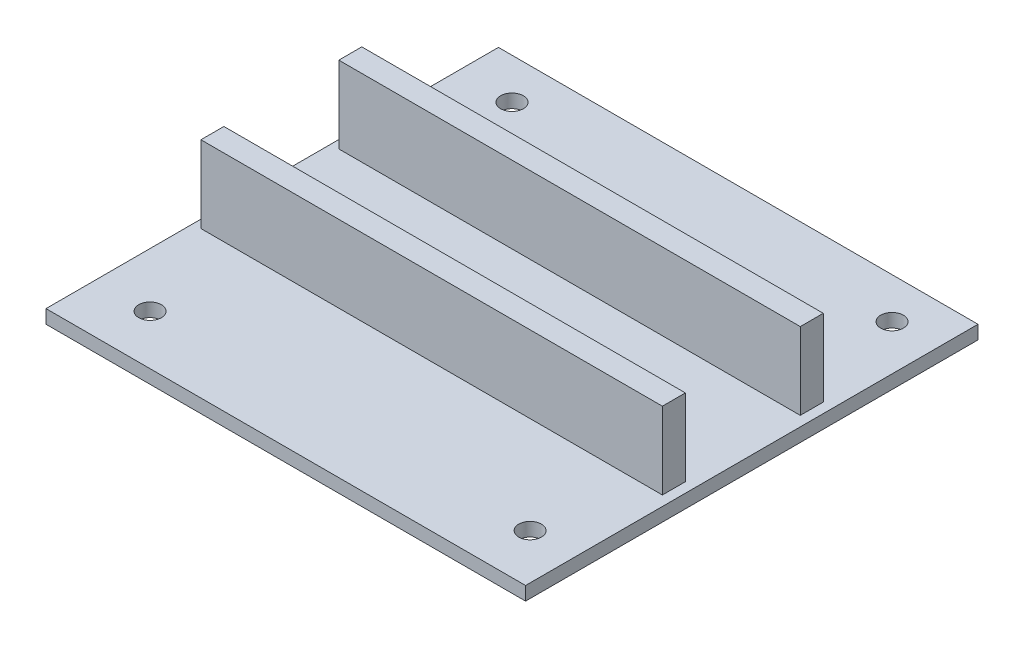
ISO-10303-21;
HEADER;
FILE_DESCRIPTION(('STEP AP214'),'2;1');
FILE_NAME('part.step','',(''),(''),'','','');
FILE_SCHEMA(('AUTOMOTIVE_DESIGN { 1 0 10303 214 1 1 1 1 }'));
ENDSEC;
DATA;
#1=APPLICATION_CONTEXT('core data for automotive mechanical design processes');
#2=APPLICATION_PROTOCOL_DEFINITION('international standard','automotive_design',2000,#1);
#3=PRODUCT_CONTEXT('',#1,'mechanical');
#4=PRODUCT('Part','Part','',(#3));
#5=PRODUCT_RELATED_PRODUCT_CATEGORY('part','',(#4));
#6=PRODUCT_DEFINITION_FORMATION('','',#4);
#7=PRODUCT_DEFINITION_CONTEXT('part definition',#1,'design');
#8=PRODUCT_DEFINITION('design','',#6,#7);
#9=PRODUCT_DEFINITION_SHAPE('','',#8);
#10=(LENGTH_UNIT() NAMED_UNIT(*) SI_UNIT(.MILLI.,.METRE.));
#11=(NAMED_UNIT(*) PLANE_ANGLE_UNIT() SI_UNIT($,.RADIAN.));
#12=(NAMED_UNIT(*) SI_UNIT($,.STERADIAN.) SOLID_ANGLE_UNIT());
#13=UNCERTAINTY_MEASURE_WITH_UNIT(LENGTH_MEASURE(1.E-05),#10,'distance_accuracy_value','');
#14=(GEOMETRIC_REPRESENTATION_CONTEXT(3) GLOBAL_UNCERTAINTY_ASSIGNED_CONTEXT((#13)) GLOBAL_UNIT_ASSIGNED_CONTEXT((#10,
#11,#12)) REPRESENTATION_CONTEXT('',''));
#15=CARTESIAN_POINT('',(0.,0.,0.));
#16=DIRECTION('',(0.,0.,1.));
#17=DIRECTION('',(1.,0.,0.));
#18=AXIS2_PLACEMENT_3D('',#15,#16,#17);
#19=CARTESIAN_POINT('',(0.,1.5,0.));
#20=DIRECTION('',(0.,-1.,0.));
#21=DIRECTION('',(0.,0.,-1.));
#22=AXIS2_PLACEMENT_3D('',#19,#20,#21);
#23=PLANE('',#22);
#24=CARTESIAN_POINT('',(-20.5,1.5,19.5));
#25=DIRECTION('',(0.,1.,0.));
#26=DIRECTION('',(0.,0.,1.));
#27=AXIS2_PLACEMENT_3D('',#24,#25,#26);
#28=CIRCLE('',#27,1.25);
#29=CARTESIAN_POINT('',(-20.5,1.5,20.75));
#30=VERTEX_POINT('',#29);
#31=EDGE_CURVE('E227',#30,#30,#28,.T.);
#32=ORIENTED_EDGE('',*,*,#31,.F.);
#33=EDGE_LOOP('',(#32));
#34=FACE_BOUND('',#33,.T.);
#35=CARTESIAN_POINT('',(21.5,1.5,19.5));
#36=DIRECTION('',(0.,1.,0.));
#37=DIRECTION('',(0.,0.,1.));
#38=AXIS2_PLACEMENT_3D('',#35,#36,#37);
#39=CIRCLE('',#38,1.25);
#40=CARTESIAN_POINT('',(21.5,1.5,20.75));
#41=VERTEX_POINT('',#40);
#42=EDGE_CURVE('E217',#41,#41,#39,.T.);
#43=ORIENTED_EDGE('',*,*,#42,.F.);
#44=EDGE_LOOP('',(#43));
#45=FACE_BOUND('',#44,.T.);
#46=CARTESIAN_POINT('',(-20.5,1.5,-20.5));
#47=DIRECTION('',(0.,1.,0.));
#48=DIRECTION('',(0.,0.,1.));
#49=AXIS2_PLACEMENT_3D('',#46,#47,#48);
#50=CIRCLE('',#49,1.25);
#51=CARTESIAN_POINT('',(-20.5,1.5,-19.25));
#52=VERTEX_POINT('',#51);
#53=EDGE_CURVE('E214',#52,#52,#50,.T.);
#54=ORIENTED_EDGE('',*,*,#53,.F.);
#55=EDGE_LOOP('',(#54));
#56=FACE_BOUND('',#55,.T.);
#57=CARTESIAN_POINT('',(21.5,1.5,-20.5));
#58=DIRECTION('',(0.,1.,0.));
#59=DIRECTION('',(0.,0.,1.));
#60=AXIS2_PLACEMENT_3D('',#57,#58,#59);
#61=CIRCLE('',#60,1.25);
#62=CARTESIAN_POINT('',(21.5,1.5,-19.25));
#63=VERTEX_POINT('',#62);
#64=EDGE_CURVE('E211',#63,#63,#61,.T.);
#65=ORIENTED_EDGE('',*,*,#64,.F.);
#66=EDGE_LOOP('',(#65));
#67=FACE_BOUND('',#66,.T.);
#68=DIRECTION('',(0.,0.,1.));
#69=VECTOR('',#68,1.);
#70=CARTESIAN_POINT('',(-25.6,1.5,-9.00000000000001));
#71=LINE('',#70,#69);
#72=CARTESIAN_POINT('',(-25.6,1.5,-9.00000000000001));
#73=VERTEX_POINT('',#72);
#74=CARTESIAN_POINT('',(-25.6,1.5,-6.46));
#75=VERTEX_POINT('',#74);
#76=EDGE_CURVE('E144',#73,#75,#71,.T.);
#77=ORIENTED_EDGE('',*,*,#76,.F.);
#78=DIRECTION('',(-1.,0.,0.));
#79=VECTOR('',#78,1.);
#80=CARTESIAN_POINT('',(-25.6,1.5,-9.00000000000001));
#81=LINE('',#80,#79);
#82=CARTESIAN_POINT('',(25.4,1.5,-9.00000000000001));
#83=VERTEX_POINT('',#82);
#84=EDGE_CURVE('E157',#83,#73,#81,.T.);
#85=ORIENTED_EDGE('',*,*,#84,.F.);
#86=DIRECTION('',(0.,0.,-1.));
#87=VECTOR('',#86,1.);
#88=CARTESIAN_POINT('',(25.4,1.5,-9.00000000000001));
#89=LINE('',#88,#87);
#90=CARTESIAN_POINT('',(25.4,1.5,-6.46));
#91=VERTEX_POINT('',#90);
#92=EDGE_CURVE('E166',#91,#83,#89,.T.);
#93=ORIENTED_EDGE('',*,*,#92,.F.);
#94=DIRECTION('',(1.,0.,0.));
#95=VECTOR('',#94,1.);
#96=CARTESIAN_POINT('',(-25.6,1.5,-6.46));
#97=LINE('',#96,#95);
#98=EDGE_CURVE('E147',#75,#91,#97,.T.);
#99=ORIENTED_EDGE('',*,*,#98,.F.);
#100=EDGE_LOOP('',(#77,#85,#93,#99));
#101=FACE_BOUND('',#100,.T.);
#102=DIRECTION('',(0.,0.,1.));
#103=VECTOR('',#102,1.);
#104=CARTESIAN_POINT('',(-26.5,1.5,-25.));
#105=LINE('',#104,#103);
#106=CARTESIAN_POINT('',(-26.5,1.5,-25.));
#107=VERTEX_POINT('',#106);
#108=CARTESIAN_POINT('',(-26.5,1.5,25.));
#109=VERTEX_POINT('',#108);
#110=EDGE_CURVE('E183',#107,#109,#105,.T.);
#111=ORIENTED_EDGE('',*,*,#110,.T.);
#112=DIRECTION('',(1.,0.,0.));
#113=VECTOR('',#112,1.);
#114=CARTESIAN_POINT('',(26.5,1.5,25.));
#115=LINE('',#114,#113);
#116=CARTESIAN_POINT('',(26.5,1.5,25.));
#117=VERTEX_POINT('',#116);
#118=EDGE_CURVE('E186',#109,#117,#115,.T.);
#119=ORIENTED_EDGE('',*,*,#118,.T.);
#120=DIRECTION('',(0.,0.,-1.));
#121=VECTOR('',#120,1.);
#122=CARTESIAN_POINT('',(26.5,1.5,-25.));
#123=LINE('',#122,#121);
#124=CARTESIAN_POINT('',(26.5,1.5,-25.));
#125=VERTEX_POINT('',#124);
#126=EDGE_CURVE('E189',#117,#125,#123,.T.);
#127=ORIENTED_EDGE('',*,*,#126,.T.);
#128=DIRECTION('',(-1.,0.,0.));
#129=VECTOR('',#128,1.);
#130=CARTESIAN_POINT('',(26.5,1.5,-25.));
#131=LINE('',#130,#129);
#132=EDGE_CURVE('E191',#125,#107,#131,.T.);
#133=ORIENTED_EDGE('',*,*,#132,.T.);
#134=EDGE_LOOP('',(#111,#119,#127,#133));
#135=FACE_BOUND('',#134,.T.);
#136=DIRECTION('',(0.,0.,1.));
#137=VECTOR('',#136,1.);
#138=CARTESIAN_POINT('',(-25.6,1.5,6.23999999999999));
#139=LINE('',#138,#137);
#140=CARTESIAN_POINT('',(-25.6,1.5,6.23999999999999));
#141=VERTEX_POINT('',#140);
#142=CARTESIAN_POINT('',(-25.6,1.5,8.77999999999999));
#143=VERTEX_POINT('',#142);
#144=EDGE_CURVE('E143',#141,#143,#139,.T.);
#145=ORIENTED_EDGE('',*,*,#144,.F.);
#146=DIRECTION('',(-1.,0.,0.));
#147=VECTOR('',#146,1.);
#148=CARTESIAN_POINT('',(-25.6,1.5,6.23999999999999));
#149=LINE('',#148,#147);
#150=CARTESIAN_POINT('',(25.4,1.5,6.23999999999999));
#151=VERTEX_POINT('',#150);
#152=EDGE_CURVE('E140',#151,#141,#149,.T.);
#153=ORIENTED_EDGE('',*,*,#152,.F.);
#154=DIRECTION('',(0.,0.,-1.));
#155=VECTOR('',#154,1.);
#156=CARTESIAN_POINT('',(25.4,1.5,6.23999999999999));
#157=LINE('',#156,#155);
#158=CARTESIAN_POINT('',(25.4,1.5,8.77999999999999));
#159=VERTEX_POINT('',#158);
#160=EDGE_CURVE('E54',#159,#151,#157,.T.);
#161=ORIENTED_EDGE('',*,*,#160,.F.);
#162=DIRECTION('',(1.,0.,0.));
#163=VECTOR('',#162,1.);
#164=CARTESIAN_POINT('',(-25.6,1.5,8.77999999999999));
#165=LINE('',#164,#163);
#166=EDGE_CURVE('E49',#143,#159,#165,.T.);
#167=ORIENTED_EDGE('',*,*,#166,.F.);
#168=EDGE_LOOP('',(#145,#153,#161,#167));
#169=FACE_BOUND('',#168,.T.);
#170=ADVANCED_FACE('F32',(#34,#45,#56,#67,#101,#135,#169),#23,.F.);
#171=CARTESIAN_POINT('',(-26.5,1.5,-25.));
#172=DIRECTION('',(1.,0.,0.));
#173=DIRECTION('',(0.,0.,-1.));
#174=AXIS2_PLACEMENT_3D('',#171,#172,#173);
#175=PLANE('',#174);
#176=DIRECTION('',(0.,0.,1.));
#177=VECTOR('',#176,1.);
#178=CARTESIAN_POINT('',(-26.5,0.,-25.));
#179=LINE('',#178,#177);
#180=CARTESIAN_POINT('',(-26.5,0.,-25.));
#181=VERTEX_POINT('',#180);
#182=CARTESIAN_POINT('',(-26.5,0.,25.));
#183=VERTEX_POINT('',#182);
#184=EDGE_CURVE('E182',#181,#183,#179,.T.);
#185=ORIENTED_EDGE('',*,*,#184,.T.);
#186=DIRECTION('',(0.,-1.,0.));
#187=VECTOR('',#186,1.);
#188=CARTESIAN_POINT('',(-26.5,1.5,25.));
#189=LINE('',#188,#187);
#190=EDGE_CURVE('E11',#109,#183,#189,.T.);
#191=ORIENTED_EDGE('',*,*,#190,.F.);
#192=ORIENTED_EDGE('',*,*,#110,.F.);
#193=DIRECTION('',(0.,-1.,0.));
#194=VECTOR('',#193,1.);
#195=CARTESIAN_POINT('',(-26.5,1.5,-25.));
#196=LINE('',#195,#194);
#197=EDGE_CURVE('E193',#107,#181,#196,.T.);
#198=ORIENTED_EDGE('',*,*,#197,.T.);
#199=EDGE_LOOP('',(#185,#191,#192,#198));
#200=FACE_BOUND('',#199,.T.);
#201=ADVANCED_FACE('F34',(#200),#175,.F.);
#202=CARTESIAN_POINT('',(26.5,1.5,25.));
#203=DIRECTION('',(0.,0.,-1.));
#204=DIRECTION('',(-1.,0.,0.));
#205=AXIS2_PLACEMENT_3D('',#202,#203,#204);
#206=PLANE('',#205);
#207=DIRECTION('',(1.,0.,0.));
#208=VECTOR('',#207,1.);
#209=CARTESIAN_POINT('',(26.5,0.,25.));
#210=LINE('',#209,#208);
#211=CARTESIAN_POINT('',(26.5,0.,25.));
#212=VERTEX_POINT('',#211);
#213=EDGE_CURVE('E196',#183,#212,#210,.T.);
#214=ORIENTED_EDGE('',*,*,#213,.T.);
#215=DIRECTION('',(0.,-1.,0.));
#216=VECTOR('',#215,1.);
#217=CARTESIAN_POINT('',(26.5,1.5,25.));
#218=LINE('',#217,#216);
#219=EDGE_CURVE('E41',#117,#212,#218,.T.);
#220=ORIENTED_EDGE('',*,*,#219,.F.);
#221=ORIENTED_EDGE('',*,*,#118,.F.);
#222=ORIENTED_EDGE('',*,*,#190,.T.);
#223=EDGE_LOOP('',(#214,#220,#221,#222));
#224=FACE_BOUND('',#223,.T.);
#225=ADVANCED_FACE('F262',(#224),#206,.F.);
#226=CARTESIAN_POINT('',(26.5,1.5,-25.));
#227=DIRECTION('',(-1.,0.,0.));
#228=DIRECTION('',(0.,0.,1.));
#229=AXIS2_PLACEMENT_3D('',#226,#227,#228);
#230=PLANE('',#229);
#231=DIRECTION('',(0.,0.,-1.));
#232=VECTOR('',#231,1.);
#233=CARTESIAN_POINT('',(26.5,0.,-25.));
#234=LINE('',#233,#232);
#235=CARTESIAN_POINT('',(26.5,0.,-25.));
#236=VERTEX_POINT('',#235);
#237=EDGE_CURVE('E198',#212,#236,#234,.T.);
#238=ORIENTED_EDGE('',*,*,#237,.T.);
#239=DIRECTION('',(0.,-1.,0.));
#240=VECTOR('',#239,1.);
#241=CARTESIAN_POINT('',(26.5,1.5,-25.));
#242=LINE('',#241,#240);
#243=EDGE_CURVE('E203',#125,#236,#242,.T.);
#244=ORIENTED_EDGE('',*,*,#243,.F.);
#245=ORIENTED_EDGE('',*,*,#126,.F.);
#246=ORIENTED_EDGE('',*,*,#219,.T.);
#247=EDGE_LOOP('',(#238,#244,#245,#246));
#248=FACE_BOUND('',#247,.T.);
#249=ADVANCED_FACE('F276',(#248),#230,.F.);
#250=CARTESIAN_POINT('',(26.5,1.5,-25.));
#251=DIRECTION('',(0.,0.,1.));
#252=DIRECTION('',(1.,0.,0.));
#253=AXIS2_PLACEMENT_3D('',#250,#251,#252);
#254=PLANE('',#253);
#255=DIRECTION('',(-1.,0.,0.));
#256=VECTOR('',#255,1.);
#257=CARTESIAN_POINT('',(26.5,0.,-25.));
#258=LINE('',#257,#256);
#259=EDGE_CURVE('E187',#236,#181,#258,.T.);
#260=ORIENTED_EDGE('',*,*,#259,.T.);
#261=ORIENTED_EDGE('',*,*,#197,.F.);
#262=ORIENTED_EDGE('',*,*,#132,.F.);
#263=ORIENTED_EDGE('',*,*,#243,.T.);
#264=EDGE_LOOP('',(#260,#261,#262,#263));
#265=FACE_BOUND('',#264,.T.);
#266=ADVANCED_FACE('F272',(#265),#254,.F.);
#267=CARTESIAN_POINT('',(0.,0.,0.));
#268=DIRECTION('',(0.,-1.,0.));
#269=DIRECTION('',(0.,0.,-1.));
#270=AXIS2_PLACEMENT_3D('',#267,#268,#269);
#271=PLANE('',#270);
#272=CARTESIAN_POINT('',(-20.5,0.,19.5));
#273=DIRECTION('',(0.,-1.,0.));
#274=DIRECTION('',(0.,0.,-1.));
#275=AXIS2_PLACEMENT_3D('',#272,#273,#274);
#276=CIRCLE('',#275,1.25);
#277=CARTESIAN_POINT('',(-20.5,0.,18.25));
#278=VERTEX_POINT('',#277);
#279=EDGE_CURVE('E36',#278,#278,#276,.T.);
#280=ORIENTED_EDGE('',*,*,#279,.F.);
#281=EDGE_LOOP('',(#280));
#282=FACE_BOUND('',#281,.T.);
#283=CARTESIAN_POINT('',(21.5,0.,19.5));
#284=DIRECTION('',(0.,-1.,0.));
#285=DIRECTION('',(0.,0.,-1.));
#286=AXIS2_PLACEMENT_3D('',#283,#284,#285);
#287=CIRCLE('',#286,1.25);
#288=CARTESIAN_POINT('',(21.5,0.,18.25));
#289=VERTEX_POINT('',#288);
#290=EDGE_CURVE('E215',#289,#289,#287,.T.);
#291=ORIENTED_EDGE('',*,*,#290,.F.);
#292=EDGE_LOOP('',(#291));
#293=FACE_BOUND('',#292,.T.);
#294=CARTESIAN_POINT('',(-20.5,0.,-20.5));
#295=DIRECTION('',(0.,-1.,0.));
#296=DIRECTION('',(0.,0.,-1.));
#297=AXIS2_PLACEMENT_3D('',#294,#295,#296);
#298=CIRCLE('',#297,1.25);
#299=CARTESIAN_POINT('',(-20.5,0.,-21.75));
#300=VERTEX_POINT('',#299);
#301=EDGE_CURVE('E212',#300,#300,#298,.T.);
#302=ORIENTED_EDGE('',*,*,#301,.F.);
#303=EDGE_LOOP('',(#302));
#304=FACE_BOUND('',#303,.T.);
#305=CARTESIAN_POINT('',(21.5,0.,-20.5));
#306=DIRECTION('',(0.,-1.,0.));
#307=DIRECTION('',(0.,0.,-1.));
#308=AXIS2_PLACEMENT_3D('',#305,#306,#307);
#309=CIRCLE('',#308,1.25);
#310=CARTESIAN_POINT('',(21.5,0.,-21.75));
#311=VERTEX_POINT('',#310);
#312=EDGE_CURVE('E208',#311,#311,#309,.T.);
#313=ORIENTED_EDGE('',*,*,#312,.F.);
#314=EDGE_LOOP('',(#313));
#315=FACE_BOUND('',#314,.T.);
#316=ORIENTED_EDGE('',*,*,#184,.F.);
#317=ORIENTED_EDGE('',*,*,#259,.F.);
#318=ORIENTED_EDGE('',*,*,#237,.F.);
#319=ORIENTED_EDGE('',*,*,#213,.F.);
#320=EDGE_LOOP('',(#316,#317,#318,#319));
#321=FACE_BOUND('',#320,.T.);
#322=ADVANCED_FACE('F270',(#282,#293,#304,#315,#321),#271,.T.);
#323=CARTESIAN_POINT('',(-25.6,10.,-9.00000000000001));
#324=DIRECTION('',(1.,0.,0.));
#325=DIRECTION('',(0.,0.,-1.));
#326=AXIS2_PLACEMENT_3D('',#323,#324,#325);
#327=PLANE('',#326);
#328=ORIENTED_EDGE('',*,*,#76,.T.);
#329=DIRECTION('',(0.,-1.,0.));
#330=VECTOR('',#329,1.);
#331=CARTESIAN_POINT('',(-25.6,10.,-6.46));
#332=LINE('',#331,#330);
#333=CARTESIAN_POINT('',(-25.6,10.,-6.46));
#334=VERTEX_POINT('',#333);
#335=EDGE_CURVE('E179',#334,#75,#332,.T.);
#336=ORIENTED_EDGE('',*,*,#335,.F.);
#337=DIRECTION('',(0.,0.,1.));
#338=VECTOR('',#337,1.);
#339=CARTESIAN_POINT('',(-25.6,10.,-9.00000000000001));
#340=LINE('',#339,#338);
#341=CARTESIAN_POINT('',(-25.6,10.,-9.00000000000001));
#342=VERTEX_POINT('',#341);
#343=EDGE_CURVE('E153',#342,#334,#340,.T.);
#344=ORIENTED_EDGE('',*,*,#343,.F.);
#345=DIRECTION('',(0.,-1.,0.));
#346=VECTOR('',#345,1.);
#347=CARTESIAN_POINT('',(-25.6,10.,-9.00000000000001));
#348=LINE('',#347,#346);
#349=EDGE_CURVE('E162',#342,#73,#348,.T.);
#350=ORIENTED_EDGE('',*,*,#349,.T.);
#351=EDGE_LOOP('',(#328,#336,#344,#350));
#352=FACE_BOUND('',#351,.T.);
#353=ADVANCED_FACE('F268',(#352),#327,.F.);
#354=CARTESIAN_POINT('',(-25.6,10.,-6.46));
#355=DIRECTION('',(0.,0.,-1.));
#356=DIRECTION('',(-1.,0.,0.));
#357=AXIS2_PLACEMENT_3D('',#354,#355,#356);
#358=PLANE('',#357);
#359=ORIENTED_EDGE('',*,*,#98,.T.);
#360=DIRECTION('',(0.,-1.,0.));
#361=VECTOR('',#360,1.);
#362=CARTESIAN_POINT('',(25.4,10.,-6.46));
#363=LINE('',#362,#361);
#364=CARTESIAN_POINT('',(25.4,10.,-6.46));
#365=VERTEX_POINT('',#364);
#366=EDGE_CURVE('E176',#365,#91,#363,.T.);
#367=ORIENTED_EDGE('',*,*,#366,.F.);
#368=DIRECTION('',(1.,0.,0.));
#369=VECTOR('',#368,1.);
#370=CARTESIAN_POINT('',(-25.6,10.,-6.46));
#371=LINE('',#370,#369);
#372=EDGE_CURVE('E156',#334,#365,#371,.T.);
#373=ORIENTED_EDGE('',*,*,#372,.F.);
#374=ORIENTED_EDGE('',*,*,#335,.T.);
#375=EDGE_LOOP('',(#359,#367,#373,#374));
#376=FACE_BOUND('',#375,.T.);
#377=ADVANCED_FACE('F320',(#376),#358,.F.);
#378=CARTESIAN_POINT('',(25.4,10.,-9.00000000000001));
#379=DIRECTION('',(-1.,0.,0.));
#380=DIRECTION('',(0.,0.,1.));
#381=AXIS2_PLACEMENT_3D('',#378,#379,#380);
#382=PLANE('',#381);
#383=ORIENTED_EDGE('',*,*,#92,.T.);
#384=DIRECTION('',(0.,-1.,0.));
#385=VECTOR('',#384,1.);
#386=CARTESIAN_POINT('',(25.4,10.,-9.00000000000001));
#387=LINE('',#386,#385);
#388=CARTESIAN_POINT('',(25.4,10.,-9.00000000000001));
#389=VERTEX_POINT('',#388);
#390=EDGE_CURVE('E173',#389,#83,#387,.T.);
#391=ORIENTED_EDGE('',*,*,#390,.F.);
#392=DIRECTION('',(0.,0.,-1.));
#393=VECTOR('',#392,1.);
#394=CARTESIAN_POINT('',(25.4,10.,-9.00000000000001));
#395=LINE('',#394,#393);
#396=EDGE_CURVE('E159',#365,#389,#395,.T.);
#397=ORIENTED_EDGE('',*,*,#396,.F.);
#398=ORIENTED_EDGE('',*,*,#366,.T.);
#399=EDGE_LOOP('',(#383,#391,#397,#398));
#400=FACE_BOUND('',#399,.T.);
#401=ADVANCED_FACE('F327',(#400),#382,.F.);
#402=CARTESIAN_POINT('',(-25.6,10.,-9.00000000000001));
#403=DIRECTION('',(0.,0.,1.));
#404=DIRECTION('',(1.,0.,0.));
#405=AXIS2_PLACEMENT_3D('',#402,#403,#404);
#406=PLANE('',#405);
#407=ORIENTED_EDGE('',*,*,#84,.T.);
#408=ORIENTED_EDGE('',*,*,#349,.F.);
#409=DIRECTION('',(-1.,0.,0.));
#410=VECTOR('',#409,1.);
#411=CARTESIAN_POINT('',(-25.6,10.,-9.00000000000001));
#412=LINE('',#411,#410);
#413=EDGE_CURVE('E161',#389,#342,#412,.T.);
#414=ORIENTED_EDGE('',*,*,#413,.F.);
#415=ORIENTED_EDGE('',*,*,#390,.T.);
#416=EDGE_LOOP('',(#407,#408,#414,#415));
#417=FACE_BOUND('',#416,.T.);
#418=ADVANCED_FACE('F334',(#417),#406,.F.);
#419=CARTESIAN_POINT('',(0.,10.,0.));
#420=DIRECTION('',(0.,1.,0.));
#421=DIRECTION('',(0.,0.,1.));
#422=AXIS2_PLACEMENT_3D('',#419,#420,#421);
#423=PLANE('',#422);
#424=ORIENTED_EDGE('',*,*,#343,.T.);
#425=ORIENTED_EDGE('',*,*,#372,.T.);
#426=ORIENTED_EDGE('',*,*,#396,.T.);
#427=ORIENTED_EDGE('',*,*,#413,.T.);
#428=EDGE_LOOP('',(#424,#425,#426,#427));
#429=FACE_BOUND('',#428,.T.);
#430=ADVANCED_FACE('F342',(#429),#423,.T.);
#431=CARTESIAN_POINT('',(-25.6,10.,6.23999999999999));
#432=DIRECTION('',(1.,0.,0.));
#433=DIRECTION('',(0.,0.,-1.));
#434=AXIS2_PLACEMENT_3D('',#431,#432,#433);
#435=PLANE('',#434);
#436=ORIENTED_EDGE('',*,*,#144,.T.);
#437=DIRECTION('',(0.,-1.,0.));
#438=VECTOR('',#437,1.);
#439=CARTESIAN_POINT('',(-25.6,10.,8.77999999999999));
#440=LINE('',#439,#438);
#441=CARTESIAN_POINT('',(-25.6,10.,8.77999999999999));
#442=VERTEX_POINT('',#441);
#443=EDGE_CURVE('E124',#442,#143,#440,.T.);
#444=ORIENTED_EDGE('',*,*,#443,.F.);
#445=DIRECTION('',(0.,0.,1.));
#446=VECTOR('',#445,1.);
#447=CARTESIAN_POINT('',(-25.6,10.,6.23999999999999));
#448=LINE('',#447,#446);
#449=CARTESIAN_POINT('',(-25.6,10.,6.23999999999999));
#450=VERTEX_POINT('',#449);
#451=EDGE_CURVE('E131',#450,#442,#448,.T.);
#452=ORIENTED_EDGE('',*,*,#451,.F.);
#453=DIRECTION('',(0.,-1.,0.));
#454=VECTOR('',#453,1.);
#455=CARTESIAN_POINT('',(-25.6,10.,6.23999999999999));
#456=LINE('',#455,#454);
#457=EDGE_CURVE('E234',#450,#141,#456,.T.);
#458=ORIENTED_EDGE('',*,*,#457,.T.);
#459=EDGE_LOOP('',(#436,#444,#452,#458));
#460=FACE_BOUND('',#459,.T.);
#461=ADVANCED_FACE('F142',(#460),#435,.F.);
#462=CARTESIAN_POINT('',(-25.6,10.,8.77999999999999));
#463=DIRECTION('',(0.,0.,-1.));
#464=DIRECTION('',(-1.,0.,0.));
#465=AXIS2_PLACEMENT_3D('',#462,#463,#464);
#466=PLANE('',#465);
#467=ORIENTED_EDGE('',*,*,#166,.T.);
#468=DIRECTION('',(0.,-1.,0.));
#469=VECTOR('',#468,1.);
#470=CARTESIAN_POINT('',(25.4,10.,8.77999999999999));
#471=LINE('',#470,#469);
#472=CARTESIAN_POINT('',(25.4,10.,8.77999999999999));
#473=VERTEX_POINT('',#472);
#474=EDGE_CURVE('E127',#473,#159,#471,.T.);
#475=ORIENTED_EDGE('',*,*,#474,.F.);
#476=DIRECTION('',(1.,0.,0.));
#477=VECTOR('',#476,1.);
#478=CARTESIAN_POINT('',(-25.6,10.,8.77999999999999));
#479=LINE('',#478,#477);
#480=EDGE_CURVE('E120',#442,#473,#479,.T.);
#481=ORIENTED_EDGE('',*,*,#480,.F.);
#482=ORIENTED_EDGE('',*,*,#443,.T.);
#483=EDGE_LOOP('',(#467,#475,#481,#482));
#484=FACE_BOUND('',#483,.T.);
#485=ADVANCED_FACE('F122',(#484),#466,.F.);
#486=CARTESIAN_POINT('',(25.4,10.,6.23999999999999));
#487=DIRECTION('',(-1.,0.,0.));
#488=DIRECTION('',(0.,0.,1.));
#489=AXIS2_PLACEMENT_3D('',#486,#487,#488);
#490=PLANE('',#489);
#491=ORIENTED_EDGE('',*,*,#160,.T.);
#492=DIRECTION('',(0.,-1.,0.));
#493=VECTOR('',#492,1.);
#494=CARTESIAN_POINT('',(25.4,10.,6.23999999999999));
#495=LINE('',#494,#493);
#496=CARTESIAN_POINT('',(25.4,10.,6.23999999999999));
#497=VERTEX_POINT('',#496);
#498=EDGE_CURVE('E149',#497,#151,#495,.T.);
#499=ORIENTED_EDGE('',*,*,#498,.F.);
#500=DIRECTION('',(0.,0.,-1.));
#501=VECTOR('',#500,1.);
#502=CARTESIAN_POINT('',(25.4,10.,6.23999999999999));
#503=LINE('',#502,#501);
#504=EDGE_CURVE('E130',#473,#497,#503,.T.);
#505=ORIENTED_EDGE('',*,*,#504,.F.);
#506=ORIENTED_EDGE('',*,*,#474,.T.);
#507=EDGE_LOOP('',(#491,#499,#505,#506));
#508=FACE_BOUND('',#507,.T.);
#509=ADVANCED_FACE('F245',(#508),#490,.F.);
#510=CARTESIAN_POINT('',(-25.6,10.,6.23999999999999));
#511=DIRECTION('',(0.,0.,1.));
#512=DIRECTION('',(1.,0.,0.));
#513=AXIS2_PLACEMENT_3D('',#510,#511,#512);
#514=PLANE('',#513);
#515=ORIENTED_EDGE('',*,*,#152,.T.);
#516=ORIENTED_EDGE('',*,*,#457,.F.);
#517=DIRECTION('',(-1.,0.,0.));
#518=VECTOR('',#517,1.);
#519=CARTESIAN_POINT('',(-25.6,10.,6.23999999999999));
#520=LINE('',#519,#518);
#521=EDGE_CURVE('E136',#497,#450,#520,.T.);
#522=ORIENTED_EDGE('',*,*,#521,.F.);
#523=ORIENTED_EDGE('',*,*,#498,.T.);
#524=EDGE_LOOP('',(#515,#516,#522,#523));
#525=FACE_BOUND('',#524,.T.);
#526=ADVANCED_FACE('F243',(#525),#514,.F.);
#527=CARTESIAN_POINT('',(0.,10.,0.));
#528=DIRECTION('',(0.,1.,0.));
#529=DIRECTION('',(0.,0.,1.));
#530=AXIS2_PLACEMENT_3D('',#527,#528,#529);
#531=PLANE('',#530);
#532=ORIENTED_EDGE('',*,*,#451,.T.);
#533=ORIENTED_EDGE('',*,*,#480,.T.);
#534=ORIENTED_EDGE('',*,*,#504,.T.);
#535=ORIENTED_EDGE('',*,*,#521,.T.);
#536=EDGE_LOOP('',(#532,#533,#534,#535));
#537=FACE_BOUND('',#536,.T.);
#538=ADVANCED_FACE('F134',(#537),#531,.T.);
#539=CARTESIAN_POINT('',(21.5,-7.,-20.5));
#540=DIRECTION('',(0.,1.,0.));
#541=DIRECTION('',(0.,0.,1.));
#542=AXIS2_PLACEMENT_3D('',#539,#540,#541);
#543=CYLINDRICAL_SURFACE('',#542,1.25);
#544=ORIENTED_EDGE('',*,*,#312,.T.);
#545=EDGE_LOOP('',(#544));
#546=FACE_BOUND('',#545,.T.);
#547=ORIENTED_EDGE('',*,*,#64,.T.);
#548=EDGE_LOOP('',(#547));
#549=FACE_BOUND('',#548,.T.);
#550=ADVANCED_FACE('F378',(#546,#549),#543,.F.);
#551=CARTESIAN_POINT('',(-20.5,-7.,-20.5));
#552=DIRECTION('',(0.,1.,0.));
#553=DIRECTION('',(0.,0.,1.));
#554=AXIS2_PLACEMENT_3D('',#551,#552,#553);
#555=CYLINDRICAL_SURFACE('',#554,1.25);
#556=ORIENTED_EDGE('',*,*,#301,.T.);
#557=EDGE_LOOP('',(#556));
#558=FACE_BOUND('',#557,.T.);
#559=ORIENTED_EDGE('',*,*,#53,.T.);
#560=EDGE_LOOP('',(#559));
#561=FACE_BOUND('',#560,.T.);
#562=ADVANCED_FACE('F387',(#558,#561),#555,.F.);
#563=CARTESIAN_POINT('',(21.5,-7.,19.5));
#564=DIRECTION('',(0.,1.,0.));
#565=DIRECTION('',(0.,0.,1.));
#566=AXIS2_PLACEMENT_3D('',#563,#564,#565);
#567=CYLINDRICAL_SURFACE('',#566,1.25);
#568=ORIENTED_EDGE('',*,*,#290,.T.);
#569=EDGE_LOOP('',(#568));
#570=FACE_BOUND('',#569,.T.);
#571=ORIENTED_EDGE('',*,*,#42,.T.);
#572=EDGE_LOOP('',(#571));
#573=FACE_BOUND('',#572,.T.);
#574=ADVANCED_FACE('F394',(#570,#573),#567,.F.);
#575=CARTESIAN_POINT('',(-20.5,-7.,19.5));
#576=DIRECTION('',(0.,1.,0.));
#577=DIRECTION('',(0.,0.,1.));
#578=AXIS2_PLACEMENT_3D('',#575,#576,#577);
#579=CYLINDRICAL_SURFACE('',#578,1.25);
#580=ORIENTED_EDGE('',*,*,#279,.T.);
#581=EDGE_LOOP('',(#580));
#582=FACE_BOUND('',#581,.T.);
#583=ORIENTED_EDGE('',*,*,#31,.T.);
#584=EDGE_LOOP('',(#583));
#585=FACE_BOUND('',#584,.T.);
#586=ADVANCED_FACE('F402',(#582,#585),#579,.F.);
#587=CLOSED_SHELL('',(#170,#201,#225,#249,#266,#322,#353,#377,#401,#418,#430,#461,#485,#509,
#526,#538,#550,#562,#574,#586));
#588=MANIFOLD_SOLID_BREP('B2',#587);
#589=ADVANCED_BREP_SHAPE_REPRESENTATION('',(#18,#588),#14);
#590=SHAPE_DEFINITION_REPRESENTATION(#9,#589);
ENDSEC;
END-ISO-10303-21;
